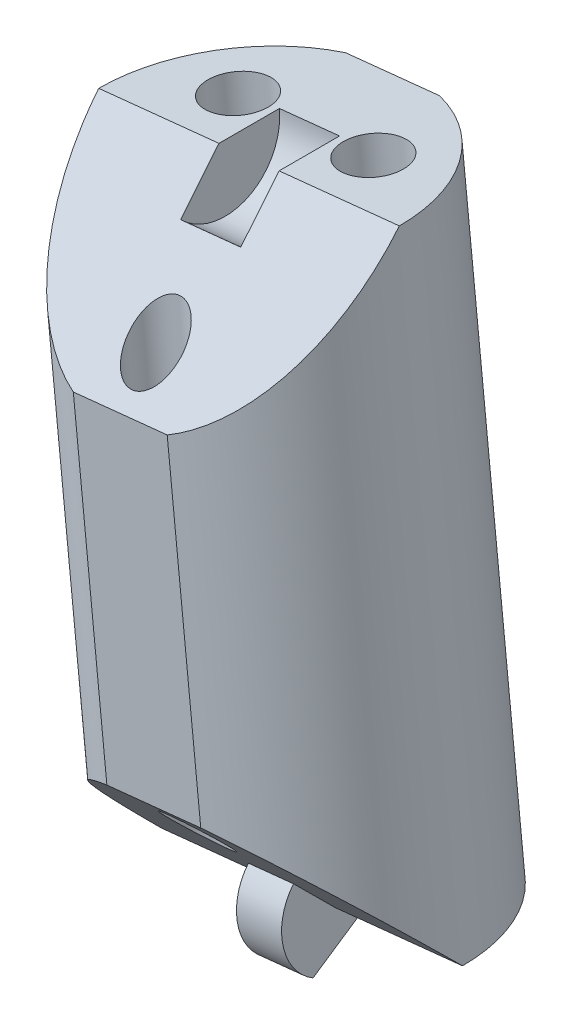
ISO-10303-21;
HEADER;
FILE_DESCRIPTION(('STEP AP214'),'2;1');
FILE_NAME('part.step','',(''),(''),'','','');
FILE_SCHEMA(('AUTOMOTIVE_DESIGN { 1 0 10303 214 1 1 1 1 }'));
ENDSEC;
DATA;
#1=APPLICATION_CONTEXT('core data for automotive mechanical design processes');
#2=APPLICATION_PROTOCOL_DEFINITION('international standard','automotive_design',2000,#1);
#3=PRODUCT_CONTEXT('',#1,'mechanical');
#4=PRODUCT('Part','Part','',(#3));
#5=PRODUCT_RELATED_PRODUCT_CATEGORY('part','',(#4));
#6=PRODUCT_DEFINITION_FORMATION('','',#4);
#7=PRODUCT_DEFINITION_CONTEXT('part definition',#1,'design');
#8=PRODUCT_DEFINITION('design','',#6,#7);
#9=PRODUCT_DEFINITION_SHAPE('','',#8);
#10=(LENGTH_UNIT() NAMED_UNIT(*) SI_UNIT(.MILLI.,.METRE.));
#11=(NAMED_UNIT(*) PLANE_ANGLE_UNIT() SI_UNIT($,.RADIAN.));
#12=(NAMED_UNIT(*) SI_UNIT($,.STERADIAN.) SOLID_ANGLE_UNIT());
#13=UNCERTAINTY_MEASURE_WITH_UNIT(LENGTH_MEASURE(1.E-05),#10,'distance_accuracy_value','');
#14=(GEOMETRIC_REPRESENTATION_CONTEXT(3) GLOBAL_UNCERTAINTY_ASSIGNED_CONTEXT((#13)) GLOBAL_UNIT_ASSIGNED_CONTEXT((#10,
#11,#12)) REPRESENTATION_CONTEXT('',''));
#15=CARTESIAN_POINT('',(0.,0.,0.));
#16=DIRECTION('',(0.,0.,1.));
#17=DIRECTION('',(1.,0.,0.));
#18=AXIS2_PLACEMENT_3D('',#15,#16,#17);
#19=CARTESIAN_POINT('',(-6.62434872213592,165.005639601074,0.));
#20=DIRECTION('',(-0.103150523023817,0.994665757729657,0.));
#21=DIRECTION('',(-0.994665757729657,-0.103150523023817,0.));
#22=AXIS2_PLACEMENT_3D('',#19,#20,#21);
#23=CYLINDRICAL_SURFACE('',#22,8.);
#24=CARTESIAN_POINT('',(-6.62434872213592,165.005639601074,0.));
#25=DIRECTION('',(0.103150523023817,-0.994665757729657,0.));
#26=DIRECTION('',(0.994665757729657,0.103150523023817,0.));
#27=AXIS2_PLACEMENT_3D('',#24,#25,#26);
#28=CIRCLE('',#27,8.);
#29=CARTESIAN_POINT('',(-4.13967445569705,165.263309525001,-7.6));
#30=VERTEX_POINT('',#29);
#31=CARTESIAN_POINT('',(1.33297733970134,165.830843785265,0.));
#32=VERTEX_POINT('',#31);
#33=EDGE_CURVE('E156',#30,#32,#28,.T.);
#34=ORIENTED_EDGE('',*,*,#33,.F.);
#35=DIRECTION('',(-0.103150523023817,0.994665757729657,0.));
#36=VECTOR('',#35,1.);
#37=CARTESIAN_POINT('',(-4.13967445569706,165.263309525001,-7.6));
#38=LINE('',#37,#36);
#39=CARTESIAN_POINT('',(-7.48403157112503,197.512467423771,-7.6));
#40=VERTEX_POINT('',#39);
#41=EDGE_CURVE('E11',#30,#40,#38,.T.);
#42=ORIENTED_EDGE('',*,*,#41,.T.);
#43=CARTESIAN_POINT('',(-9.9687058375639,197.254797499844,0.));
#44=DIRECTION('',(0.103150523023817,-0.994665757729657,0.));
#45=DIRECTION('',(0.994665757729657,0.103150523023817,0.));
#46=AXIS2_PLACEMENT_3D('',#43,#44,#45);
#47=CIRCLE('',#46,8.);
#48=CARTESIAN_POINT('',(-2.01137977572664,198.080001684034,0.));
#49=VERTEX_POINT('',#48);
#50=EDGE_CURVE('E148',#40,#49,#47,.T.);
#51=ORIENTED_EDGE('',*,*,#50,.T.);
#52=CARTESIAN_POINT('',(-9.9687058375639,197.254797499844,0.));
#53=DIRECTION('',(0.0729384343130804,-0.703334902304701,-0.707106781186543));
#54=DIRECTION('',(-0.0729384343130795,0.703334902304692,-0.707106781186552));
#55=AXIS2_PLACEMENT_3D('',#52,#53,#54);
#56=ELLIPSE('',#55,11.3137084989847,8.);
#57=CARTESIAN_POINT('',(-6.70008759614404,189.953007665026,7.6));
#58=VERTEX_POINT('',#57);
#59=EDGE_CURVE('E202',#49,#58,#56,.T.);
#60=ORIENTED_EDGE('',*,*,#59,.T.);
#61=DIRECTION('',(-0.103150523023817,0.994665757729657,0.));
#62=VECTOR('',#61,1.);
#63=CARTESIAN_POINT('',(-4.13967445569706,165.263309525001,7.6));
#64=LINE('',#63,#62);
#65=CARTESIAN_POINT('',(-4.92361843067806,172.822769283747,7.6));
#66=VERTEX_POINT('',#65);
#67=EDGE_CURVE('E174',#58,#66,#64,.F.);
#68=ORIENTED_EDGE('',*,*,#67,.T.);
#69=CARTESIAN_POINT('',(-6.62434872213592,165.005639601074,0.));
#70=DIRECTION('',(-0.0729384343130802,0.703334902304699,-0.707106781186544));
#71=DIRECTION('',(-0.0729384343130796,0.703334902304693,0.707106781186551));
#72=AXIS2_PLACEMENT_3D('',#69,#70,#71);
#73=ELLIPSE('',#72,11.3137084989847,8.);
#74=EDGE_CURVE('E207',#66,#32,#73,.T.);
#75=ORIENTED_EDGE('',*,*,#74,.T.);
#76=EDGE_LOOP('',(#34,#42,#51,#60,#68,#75));
#77=FACE_BOUND('',#76,.T.);
#78=ADVANCED_FACE('F39',(#77),#23,.T.);
#79=CARTESIAN_POINT('',(-9.9687058375639,197.254797499844,0.));
#80=DIRECTION('',(0.103150523023817,-0.994665757729657,0.));
#81=DIRECTION('',(0.994665757729657,0.103150523023817,0.));
#82=AXIS2_PLACEMENT_3D('',#79,#80,#81);
#83=PLANE('',#82);
#84=CARTESIAN_POINT('',(-13.5495025653907,196.883455616958,-3.));
#85=DIRECTION('',(0.103150523023817,-0.994665757729657,0.));
#86=DIRECTION('',(0.994665757729657,0.103150523023817,0.));
#87=AXIS2_PLACEMENT_3D('',#84,#85,#86);
#88=CIRCLE('',#87,1.6);
#89=CARTESIAN_POINT('',(-11.9580373530232,197.048496453796,-3.));
#90=VERTEX_POINT('',#89);
#91=EDGE_CURVE('E189',#90,#90,#88,.T.);
#92=ORIENTED_EDGE('',*,*,#91,.T.);
#93=EDGE_LOOP('',(#92));
#94=FACE_BOUND('',#93,.T.);
#95=CARTESIAN_POINT('',(-6.38790910973713,197.62613938273,-3.));
#96=DIRECTION('',(0.103150523023817,-0.994665757729657,0.));
#97=DIRECTION('',(0.994665757729657,0.103150523023817,0.));
#98=AXIS2_PLACEMENT_3D('',#95,#96,#97);
#99=CIRCLE('',#98,1.6);
#100=CARTESIAN_POINT('',(-4.79644389736968,197.791180219568,-3.));
#101=VERTEX_POINT('',#100);
#102=EDGE_CURVE('E184',#101,#101,#99,.T.);
#103=ORIENTED_EDGE('',*,*,#102,.T.);
#104=EDGE_LOOP('',(#103));
#105=FACE_BOUND('',#104,.T.);
#106=ORIENTED_EDGE('',*,*,#50,.F.);
#107=DIRECTION('',(0.994665757729657,0.103150523023816,0.));
#108=VECTOR('',#107,1.);
#109=CARTESIAN_POINT('',(-12.4533801040028,196.997127575917,-7.6));
#110=LINE('',#109,#108);
#111=CARTESIAN_POINT('',(-12.4533801040028,196.997127575917,-7.6));
#112=VERTEX_POINT('',#111);
#113=EDGE_CURVE('E134',#112,#40,#110,.T.);
#114=ORIENTED_EDGE('',*,*,#113,.F.);
#115=CARTESIAN_POINT('',(-17.9260318994012,196.429593315653,0.));
#116=VERTEX_POINT('',#115);
#117=EDGE_CURVE('E146',#116,#112,#47,.T.);
#118=ORIENTED_EDGE('',*,*,#117,.F.);
#119=DIRECTION('',(0.994665757729657,0.103150523023817,0.));
#120=VECTOR('',#119,1.);
#121=CARTESIAN_POINT('',(-9.9687058375639,197.254797499844,0.));
#122=LINE('',#121,#120);
#123=CARTESIAN_POINT('',(-11.5601710499314,197.089756663006,0.));
#124=VERTEX_POINT('',#123);
#125=EDGE_CURVE('E165',#116,#124,#122,.T.);
#126=ORIENTED_EDGE('',*,*,#125,.T.);
#127=DIRECTION('',(0.,0.,-1.));
#128=VECTOR('',#127,1.);
#129=CARTESIAN_POINT('',(-11.5601710499314,197.089756663006,0.));
#130=LINE('',#129,#128);
#131=CARTESIAN_POINT('',(-11.5601710499314,197.089756663006,-3.2));
#132=VERTEX_POINT('',#131);
#133=EDGE_CURVE('E256',#124,#132,#130,.T.);
#134=ORIENTED_EDGE('',*,*,#133,.T.);
#135=DIRECTION('',(-0.994665757729657,-0.103150523023817,0.));
#136=VECTOR('',#135,1.);
#137=CARTESIAN_POINT('',(-8.37724062519646,197.419838336682,-3.2));
#138=LINE('',#137,#136);
#139=CARTESIAN_POINT('',(-8.37724062519646,197.419838336682,-3.2));
#140=VERTEX_POINT('',#139);
#141=EDGE_CURVE('E269',#140,#132,#138,.T.);
#142=ORIENTED_EDGE('',*,*,#141,.F.);
#143=DIRECTION('',(0.,0.,-1.));
#144=VECTOR('',#143,1.);
#145=CARTESIAN_POINT('',(-8.37724062519647,197.419838336682,0.));
#146=LINE('',#145,#144);
#147=CARTESIAN_POINT('',(-8.37724062519647,197.419838336682,0.));
#148=VERTEX_POINT('',#147);
#149=EDGE_CURVE('E257',#148,#140,#146,.T.);
#150=ORIENTED_EDGE('',*,*,#149,.F.);
#151=EDGE_CURVE('E169',#148,#49,#122,.T.);
#152=ORIENTED_EDGE('',*,*,#151,.T.);
#153=EDGE_LOOP('',(#106,#114,#118,#126,#134,#142,#150,#152));
#154=FACE_BOUND('',#153,.T.);
#155=ADVANCED_FACE('F144',(#94,#105,#154),#83,.F.);
#156=CARTESIAN_POINT('',(1.29739327832444,198.423133704455,0.));
#157=DIRECTION('',(0.0729384343130804,-0.703334902304701,-0.707106781186543));
#158=DIRECTION('',(0.,0.708995228875744,-0.705213276556412));
#159=AXIS2_PLACEMENT_3D('',#156,#157,#158);
#160=PLANE('',#159);
#161=CARTESIAN_POINT('',(-9.40137796093292,191.784135832331,5.5));
#162=DIRECTION('',(0.0729384343130804,-0.703334902304701,-0.707106781186543));
#163=DIRECTION('',(-0.0729384343130796,0.703334902304692,-0.707106781186552));
#164=AXIS2_PLACEMENT_3D('',#161,#162,#163);
#165=ELLIPSE('',#164,1.97989898732232,1.4);
#166=CARTESIAN_POINT('',(-9.54578869316626,193.176667893152,4.1));
#167=VERTEX_POINT('',#166);
#168=EDGE_CURVE('E179',#167,#167,#165,.T.);
#169=ORIENTED_EDGE('',*,*,#168,.T.);
#170=EDGE_LOOP('',(#169));
#171=FACE_BOUND('',#170,.T.);
#172=CARTESIAN_POINT('',(-11.6694361290218,189.437667817172,7.6));
#173=VERTEX_POINT('',#172);
#174=EDGE_CURVE('E153',#173,#116,#56,.T.);
#175=ORIENTED_EDGE('',*,*,#174,.F.);
#176=DIRECTION('',(0.994665757729657,0.103150523023817,0.));
#177=VECTOR('',#176,1.);
#178=CARTESIAN_POINT('',(2.08133725330543,190.863673945709,7.6));
#179=LINE('',#178,#177);
#180=EDGE_CURVE('E198',#173,#58,#179,.T.);
#181=ORIENTED_EDGE('',*,*,#180,.T.);
#182=ORIENTED_EDGE('',*,*,#59,.F.);
#183=ORIENTED_EDGE('',*,*,#151,.F.);
#184=DIRECTION('',(-0.0729384343130776,0.703334902304677,-0.707106781186567));
#185=VECTOR('',#184,1.);
#186=CARTESIAN_POINT('',(-8.14383763539462,195.169166649307,2.26274169979702));
#187=LINE('',#186,#185);
#188=CARTESIAN_POINT('',(-8.14383763539462,195.169166649307,2.26274169979702));
#189=VERTEX_POINT('',#188);
#190=EDGE_CURVE('E266',#189,#148,#187,.T.);
#191=ORIENTED_EDGE('',*,*,#190,.F.);
#192=DIRECTION('',(-0.994665757729657,-0.103150523023817,0.));
#193=VECTOR('',#192,1.);
#194=CARTESIAN_POINT('',(-8.14383763539462,195.169166649307,2.26274169979702));
#195=LINE('',#194,#193);
#196=CARTESIAN_POINT('',(-11.3267680601295,194.839084975631,2.26274169979702));
#197=VERTEX_POINT('',#196);
#198=EDGE_CURVE('E278',#189,#197,#195,.T.);
#199=ORIENTED_EDGE('',*,*,#198,.T.);
#200=DIRECTION('',(-0.0729384343130776,0.703334902304677,-0.707106781186567));
#201=VECTOR('',#200,1.);
#202=CARTESIAN_POINT('',(-11.3267680601295,194.839084975631,2.26274169979702));
#203=LINE('',#202,#201);
#204=EDGE_CURVE('E262',#197,#124,#203,.T.);
#205=ORIENTED_EDGE('',*,*,#204,.T.);
#206=ORIENTED_EDGE('',*,*,#125,.F.);
#207=EDGE_LOOP('',(#175,#181,#182,#183,#191,#199,#205,#206));
#208=FACE_BOUND('',#207,.T.);
#209=ADVANCED_FACE('F196',(#171,#208),#160,.F.);
#210=CARTESIAN_POINT('',(-6.62434872213592,165.005639601074,0.));
#211=DIRECTION('',(0.103150523023817,-0.994665757729657,0.));
#212=DIRECTION('',(0.994665757729657,0.103150523023817,0.));
#213=AXIS2_PLACEMENT_3D('',#210,#211,#212);
#214=PLANE('',#213);
#215=DIRECTION('',(-0.994665757729657,-0.103150523023817,0.));
#216=VECTOR('',#215,1.);
#217=CARTESIAN_POINT('',(-6.62434872213592,165.005639601074,-7.6));
#218=LINE('',#217,#216);
#219=CARTESIAN_POINT('',(-9.10902298857478,164.747969677147,-7.6));
#220=VERTEX_POINT('',#219);
#221=EDGE_CURVE('E55',#30,#220,#218,.T.);
#222=ORIENTED_EDGE('',*,*,#221,.F.);
#223=ORIENTED_EDGE('',*,*,#33,.T.);
#224=DIRECTION('',(0.994665757729657,0.103150523023817,0.));
#225=VECTOR('',#224,1.);
#226=CARTESIAN_POINT('',(-6.62434872213592,165.005639601074,0.));
#227=LINE('',#226,#225);
#228=CARTESIAN_POINT('',(-5.43074981286034,165.129420228703,0.));
#229=VERTEX_POINT('',#228);
#230=EDGE_CURVE('E168',#229,#32,#227,.T.);
#231=ORIENTED_EDGE('',*,*,#230,.F.);
#232=DIRECTION('',(0.,0.,-1.));
#233=VECTOR('',#232,1.);
#234=CARTESIAN_POINT('',(-5.43074981286035,165.129420228703,0.));
#235=LINE('',#234,#233);
#236=CARTESIAN_POINT('',(-5.43074981286035,165.129420228703,-2.8));
#237=VERTEX_POINT('',#236);
#238=EDGE_CURVE('E282',#229,#237,#235,.T.);
#239=ORIENTED_EDGE('',*,*,#238,.T.);
#240=DIRECTION('',(0.994665757729657,0.103150523023817,0.));
#241=VECTOR('',#240,1.);
#242=CARTESIAN_POINT('',(-7.81794763141152,164.881858973446,-2.8));
#243=LINE('',#242,#241);
#244=CARTESIAN_POINT('',(-7.81794763141152,164.881858973446,-2.8));
#245=VERTEX_POINT('',#244);
#246=EDGE_CURVE('E203',#245,#237,#243,.T.);
#247=ORIENTED_EDGE('',*,*,#246,.F.);
#248=DIRECTION('',(0.,0.,-1.));
#249=VECTOR('',#248,1.);
#250=CARTESIAN_POINT('',(-7.81794763141152,164.881858973446,0.));
#251=LINE('',#250,#249);
#252=CARTESIAN_POINT('',(-7.81794763141152,164.881858973446,0.));
#253=VERTEX_POINT('',#252);
#254=EDGE_CURVE('E237',#253,#245,#251,.T.);
#255=ORIENTED_EDGE('',*,*,#254,.F.);
#256=CARTESIAN_POINT('',(-14.5816747839732,164.180435416884,0.));
#257=VERTEX_POINT('',#256);
#258=EDGE_CURVE('E170',#257,#253,#227,.T.);
#259=ORIENTED_EDGE('',*,*,#258,.F.);
#260=EDGE_CURVE('E160',#257,#220,#28,.T.);
#261=ORIENTED_EDGE('',*,*,#260,.T.);
#262=EDGE_LOOP('',(#222,#223,#231,#239,#247,#255,#259,#261));
#263=FACE_BOUND('',#262,.T.);
#264=CARTESIAN_POINT('',(-10.2051454499627,164.634297718189,-3.));
#265=DIRECTION('',(0.103150523023817,-0.994665757729657,0.));
#266=DIRECTION('',(0.994665757729657,0.103150523023817,0.));
#267=AXIS2_PLACEMENT_3D('',#264,#265,#266);
#268=CIRCLE('',#267,1.6);
#269=CARTESIAN_POINT('',(-8.61368023759523,164.799338555027,-3.));
#270=VERTEX_POINT('',#269);
#271=EDGE_CURVE('E185',#270,#270,#268,.T.);
#272=ORIENTED_EDGE('',*,*,#271,.F.);
#273=EDGE_LOOP('',(#272));
#274=FACE_BOUND('',#273,.T.);
#275=CARTESIAN_POINT('',(-3.04355199430916,165.37698148396,-3.));
#276=DIRECTION('',(0.103150523023817,-0.994665757729657,0.));
#277=DIRECTION('',(0.994665757729657,0.103150523023817,0.));
#278=AXIS2_PLACEMENT_3D('',#275,#276,#277);
#279=CIRCLE('',#278,1.6);
#280=CARTESIAN_POINT('',(-1.4520867819417,165.542022320798,-3.));
#281=VERTEX_POINT('',#280);
#282=EDGE_CURVE('E180',#281,#281,#279,.T.);
#283=ORIENTED_EDGE('',*,*,#282,.F.);
#284=EDGE_LOOP('',(#283));
#285=FACE_BOUND('',#284,.T.);
#286=ADVANCED_FACE('F232',(#263,#274,#285),#214,.T.);
#287=CARTESIAN_POINT('',(4.64175039375241,166.173975805685,0.));
#288=DIRECTION('',(-0.0729384343130802,0.703334902304699,-0.707106781186544));
#289=DIRECTION('',(0.,0.708995228875745,0.705213276556411));
#290=AXIS2_PLACEMENT_3D('',#287,#288,#289);
#291=PLANE('',#290);
#292=CARTESIAN_POINT('',(-7.19167659876691,170.476301268587,5.5));
#293=DIRECTION('',(-0.0729384343130802,0.703334902304699,-0.707106781186544));
#294=DIRECTION('',(-0.0729384343130797,0.703334902304693,0.707106781186551));
#295=AXIS2_PLACEMENT_3D('',#292,#293,#294);
#296=ELLIPSE('',#295,1.97989898732232,1.4);
#297=CARTESIAN_POINT('',(-7.33608733100025,171.868833329409,6.9));
#298=VERTEX_POINT('',#297);
#299=EDGE_CURVE('E175',#298,#298,#296,.T.);
#300=ORIENTED_EDGE('',*,*,#299,.T.);
#301=EDGE_LOOP('',(#300));
#302=FACE_BOUND('',#301,.T.);
#303=ORIENTED_EDGE('',*,*,#74,.F.);
#304=DIRECTION('',(-0.994665757729657,-0.103150523023817,0.));
#305=VECTOR('',#304,1.);
#306=CARTESIAN_POINT('',(3.85780641877141,173.73343556443,7.6));
#307=LINE('',#306,#305);
#308=CARTESIAN_POINT('',(-9.89296696355579,172.307429435893,7.6));
#309=VERTEX_POINT('',#308);
#310=EDGE_CURVE('E63',#66,#309,#307,.T.);
#311=ORIENTED_EDGE('',*,*,#310,.T.);
#312=EDGE_CURVE('E162',#257,#309,#73,.T.);
#313=ORIENTED_EDGE('',*,*,#312,.F.);
#314=ORIENTED_EDGE('',*,*,#258,.T.);
#315=DIRECTION('',(0.0729384343130814,-0.703334902304719,-0.707106781186525));
#316=VECTOR('',#315,1.);
#317=CARTESIAN_POINT('',(-8.02217524748815,166.851196699899,1.97989898732228));
#318=LINE('',#317,#316);
#319=CARTESIAN_POINT('',(-8.02217524748815,166.851196699899,1.97989898732228));
#320=VERTEX_POINT('',#319);
#321=EDGE_CURVE('E239',#320,#253,#318,.T.);
#322=ORIENTED_EDGE('',*,*,#321,.F.);
#323=DIRECTION('',(0.994665757729657,0.103150523023817,0.));
#324=VECTOR('',#323,1.);
#325=CARTESIAN_POINT('',(-8.02217524748815,166.851196699899,1.97989898732228));
#326=LINE('',#325,#324);
#327=CARTESIAN_POINT('',(-5.63497742893697,167.098757955156,1.97989898732228));
#328=VERTEX_POINT('',#327);
#329=EDGE_CURVE('E295',#320,#328,#326,.T.);
#330=ORIENTED_EDGE('',*,*,#329,.T.);
#331=DIRECTION('',(0.0729384343130814,-0.703334902304719,-0.707106781186525));
#332=VECTOR('',#331,1.);
#333=CARTESIAN_POINT('',(-5.63497742893697,167.098757955156,1.97989898732228));
#334=LINE('',#333,#332);
#335=EDGE_CURVE('E225',#328,#229,#334,.T.);
#336=ORIENTED_EDGE('',*,*,#335,.T.);
#337=ORIENTED_EDGE('',*,*,#230,.T.);
#338=EDGE_LOOP('',(#303,#311,#313,#314,#322,#330,#336,#337));
#339=FACE_BOUND('',#338,.T.);
#340=ADVANCED_FACE('F222',(#302,#339),#291,.F.);
#341=ORIENTED_EDGE('',*,*,#117,.T.);
#342=DIRECTION('',(-0.103150523023817,0.994665757729657,0.));
#343=VECTOR('',#342,1.);
#344=CARTESIAN_POINT('',(-9.10902298857478,164.747969677147,-7.6));
#345=LINE('',#344,#343);
#346=EDGE_CURVE('E48',#112,#220,#345,.F.);
#347=ORIENTED_EDGE('',*,*,#346,.T.);
#348=ORIENTED_EDGE('',*,*,#260,.F.);
#349=ORIENTED_EDGE('',*,*,#312,.T.);
#350=DIRECTION('',(-0.103150523023817,0.994665757729657,0.));
#351=VECTOR('',#350,1.);
#352=CARTESIAN_POINT('',(-9.10902298857478,164.747969677147,7.6));
#353=LINE('',#352,#351);
#354=EDGE_CURVE('E140',#309,#173,#353,.T.);
#355=ORIENTED_EDGE('',*,*,#354,.T.);
#356=ORIENTED_EDGE('',*,*,#174,.T.);
#357=EDGE_LOOP('',(#341,#347,#348,#349,#355,#356));
#358=FACE_BOUND('',#357,.T.);
#359=ADVANCED_FACE('F41',(#358),#23,.T.);
#360=CARTESIAN_POINT('',(-7.81794763141152,164.881858973446,-2.8));
#361=DIRECTION('',(-0.0893309733522772,0.861405814468384,0.499999999999995));
#362=DIRECTION('',(0.,-0.502007025803858,0.864863541862856));
#363=AXIS2_PLACEMENT_3D('',#360,#361,#362);
#364=PLANE('',#363);
#365=DIRECTION('',(0.0515752615119083,-0.497332878864824,0.866025403784442));
#366=VECTOR('',#365,1.);
#367=CARTESIAN_POINT('',(-5.43074981286035,165.129420228703,-2.8));
#368=LINE('',#367,#366);
#369=CARTESIAN_POINT('',(-5.18062308747397,162.717483948191,1.40000000000003));
#370=VERTEX_POINT('',#369);
#371=EDGE_CURVE('E298',#237,#370,#368,.T.);
#372=ORIENTED_EDGE('',*,*,#371,.T.);
#373=DIRECTION('',(0.994665757729657,0.103150523023817,0.));
#374=VECTOR('',#373,1.);
#375=CARTESIAN_POINT('',(-7.56782090602515,162.469922692934,1.40000000000003));
#376=LINE('',#375,#374);
#377=CARTESIAN_POINT('',(-7.56782090602515,162.469922692934,1.40000000000003));
#378=VERTEX_POINT('',#377);
#379=EDGE_CURVE('E209',#378,#370,#376,.T.);
#380=ORIENTED_EDGE('',*,*,#379,.F.);
#381=DIRECTION('',(0.0515752615119083,-0.497332878864824,0.866025403784442));
#382=VECTOR('',#381,1.);
#383=CARTESIAN_POINT('',(-7.81794763141152,164.881858973446,-2.8));
#384=LINE('',#383,#382);
#385=EDGE_CURVE('E287',#245,#378,#384,.T.);
#386=ORIENTED_EDGE('',*,*,#385,.F.);
#387=ORIENTED_EDGE('',*,*,#246,.T.);
#388=EDGE_LOOP('',(#372,#380,#386,#387));
#389=FACE_BOUND('',#388,.T.);
#390=ADVANCED_FACE('F318',(#389),#364,.F.);
#391=CARTESIAN_POINT('',(-7.81794763141152,164.881858973446,0.));
#392=DIRECTION('',(0.994665757729657,0.103150523023817,0.));
#393=DIRECTION('',(-0.103150523023817,0.994665757729657,0.));
#394=AXIS2_PLACEMENT_3D('',#391,#392,#393);
#395=CYLINDRICAL_SURFACE('',#394,2.8);
#396=CARTESIAN_POINT('',(-5.43074981286035,165.129420228703,0.));
#397=DIRECTION('',(-0.994665757729657,-0.103150523023817,0.));
#398=DIRECTION('',(-0.103150523023817,0.994665757729657,0.));
#399=AXIS2_PLACEMENT_3D('',#396,#397,#398);
#400=CIRCLE('',#399,2.8);
#401=EDGE_CURVE('E301',#370,#328,#400,.T.);
#402=ORIENTED_EDGE('',*,*,#401,.T.);
#403=ORIENTED_EDGE('',*,*,#329,.F.);
#404=CARTESIAN_POINT('',(-7.81794763141152,164.881858973446,0.));
#405=DIRECTION('',(-0.994665757729657,-0.103150523023817,0.));
#406=DIRECTION('',(-0.103150523023817,0.994665757729657,0.));
#407=AXIS2_PLACEMENT_3D('',#404,#405,#406);
#408=CIRCLE('',#407,2.8);
#409=EDGE_CURVE('E290',#378,#320,#408,.T.);
#410=ORIENTED_EDGE('',*,*,#409,.F.);
#411=ORIENTED_EDGE('',*,*,#379,.T.);
#412=EDGE_LOOP('',(#402,#403,#410,#411));
#413=FACE_BOUND('',#412,.T.);
#414=ADVANCED_FACE('F313',(#413),#395,.T.);
#415=CARTESIAN_POINT('',(-7.81794763141152,164.881858973446,0.));
#416=DIRECTION('',(0.994665757729657,0.103150523023817,0.));
#417=DIRECTION('',(-0.103150523023817,0.994665757729657,0.));
#418=AXIS2_PLACEMENT_3D('',#415,#416,#417);
#419=PLANE('',#418);
#420=ORIENTED_EDGE('',*,*,#254,.T.);
#421=ORIENTED_EDGE('',*,*,#385,.T.);
#422=ORIENTED_EDGE('',*,*,#409,.T.);
#423=ORIENTED_EDGE('',*,*,#321,.T.);
#424=EDGE_LOOP('',(#420,#421,#422,#423));
#425=FACE_BOUND('',#424,.T.);
#426=ADVANCED_FACE('F320',(#425),#419,.F.);
#427=CARTESIAN_POINT('',(-5.43074981286035,165.129420228703,0.));
#428=DIRECTION('',(0.994665757729657,0.103150523023817,0.));
#429=DIRECTION('',(-0.103150523023817,0.994665757729657,0.));
#430=AXIS2_PLACEMENT_3D('',#427,#428,#429);
#431=PLANE('',#430);
#432=ORIENTED_EDGE('',*,*,#238,.F.);
#433=ORIENTED_EDGE('',*,*,#335,.F.);
#434=ORIENTED_EDGE('',*,*,#401,.F.);
#435=ORIENTED_EDGE('',*,*,#371,.F.);
#436=EDGE_LOOP('',(#432,#433,#434,#435));
#437=FACE_BOUND('',#436,.T.);
#438=ADVANCED_FACE('F317',(#437),#431,.T.);
#439=CARTESIAN_POINT('',(-8.37724062519647,197.419838336682,0.));
#440=DIRECTION('',(-0.994665757729657,-0.103150523023817,0.));
#441=DIRECTION('',(0.103150523023817,-0.994665757729657,0.));
#442=AXIS2_PLACEMENT_3D('',#439,#440,#441);
#443=CYLINDRICAL_SURFACE('',#442,3.2);
#444=CARTESIAN_POINT('',(-11.5601710499314,197.089756663006,0.));
#445=DIRECTION('',(-0.994665757729657,-0.103150523023817,0.));
#446=DIRECTION('',(0.103150523023817,-0.994665757729657,0.));
#447=AXIS2_PLACEMENT_3D('',#444,#445,#446);
#448=CIRCLE('',#447,3.2);
#449=EDGE_CURVE('E273',#132,#197,#448,.T.);
#450=ORIENTED_EDGE('',*,*,#449,.T.);
#451=ORIENTED_EDGE('',*,*,#198,.F.);
#452=CARTESIAN_POINT('',(-8.37724062519647,197.419838336682,0.));
#453=DIRECTION('',(-0.994665757729657,-0.103150523023817,0.));
#454=DIRECTION('',(0.103150523023817,-0.994665757729657,0.));
#455=AXIS2_PLACEMENT_3D('',#452,#453,#454);
#456=CIRCLE('',#455,3.2);
#457=EDGE_CURVE('E261',#140,#189,#456,.T.);
#458=ORIENTED_EDGE('',*,*,#457,.F.);
#459=ORIENTED_EDGE('',*,*,#141,.T.);
#460=EDGE_LOOP('',(#450,#451,#458,#459));
#461=FACE_BOUND('',#460,.T.);
#462=ADVANCED_FACE('F327',(#461),#443,.F.);
#463=CARTESIAN_POINT('',(-8.37724062519647,197.419838336682,0.));
#464=DIRECTION('',(-0.994665757729657,-0.103150523023817,0.));
#465=DIRECTION('',(0.103150523023817,-0.994665757729657,0.));
#466=AXIS2_PLACEMENT_3D('',#463,#464,#465);
#467=PLANE('',#466);
#468=ORIENTED_EDGE('',*,*,#149,.T.);
#469=ORIENTED_EDGE('',*,*,#457,.T.);
#470=ORIENTED_EDGE('',*,*,#190,.T.);
#471=EDGE_LOOP('',(#468,#469,#470));
#472=FACE_BOUND('',#471,.T.);
#473=ADVANCED_FACE('F368',(#472),#467,.T.);
#474=CARTESIAN_POINT('',(-11.5601710499314,197.089756663006,0.));
#475=DIRECTION('',(-0.994665757729657,-0.103150523023817,0.));
#476=DIRECTION('',(0.103150523023817,-0.994665757729657,0.));
#477=AXIS2_PLACEMENT_3D('',#474,#475,#476);
#478=PLANE('',#477);
#479=ORIENTED_EDGE('',*,*,#133,.F.);
#480=ORIENTED_EDGE('',*,*,#204,.F.);
#481=ORIENTED_EDGE('',*,*,#449,.F.);
#482=EDGE_LOOP('',(#479,#480,#481));
#483=FACE_BOUND('',#482,.T.);
#484=ADVANCED_FACE('F358',(#483),#478,.F.);
#485=CARTESIAN_POINT('',(-6.27951723282998,161.680478811338,5.5));
#486=DIRECTION('',(-0.103150523023817,0.994665757729657,0.));
#487=DIRECTION('',(-0.994665757729657,-0.103150523023817,0.));
#488=AXIS2_PLACEMENT_3D('',#485,#486,#487);
#489=CYLINDRICAL_SURFACE('',#488,1.4);
#490=ORIENTED_EDGE('',*,*,#299,.F.);
#491=EDGE_LOOP('',(#490));
#492=FACE_BOUND('',#491,.T.);
#493=ORIENTED_EDGE('',*,*,#168,.F.);
#494=EDGE_LOOP('',(#493));
#495=FACE_BOUND('',#494,.T.);
#496=ADVANCED_FACE('F355',(#492,#495),#489,.F.);
#497=CARTESIAN_POINT('',(-2.69872050500322,162.051820694224,-3.));
#498=DIRECTION('',(-0.103150523023817,0.994665757729657,0.));
#499=DIRECTION('',(-0.994665757729657,-0.103150523023817,0.));
#500=AXIS2_PLACEMENT_3D('',#497,#498,#499);
#501=CYLINDRICAL_SURFACE('',#500,1.6);
#502=ORIENTED_EDGE('',*,*,#282,.T.);
#503=EDGE_LOOP('',(#502));
#504=FACE_BOUND('',#503,.T.);
#505=ORIENTED_EDGE('',*,*,#102,.F.);
#506=EDGE_LOOP('',(#505));
#507=FACE_BOUND('',#506,.T.);
#508=ADVANCED_FACE('F357',(#504,#507),#501,.F.);
#509=CARTESIAN_POINT('',(-9.86031396065675,161.309136928453,-3.));
#510=DIRECTION('',(-0.103150523023817,0.994665757729657,0.));
#511=DIRECTION('',(-0.994665757729657,-0.103150523023817,0.));
#512=AXIS2_PLACEMENT_3D('',#509,#510,#511);
#513=CYLINDRICAL_SURFACE('',#512,1.6);
#514=ORIENTED_EDGE('',*,*,#271,.T.);
#515=EDGE_LOOP('',(#514));
#516=FACE_BOUND('',#515,.T.);
#517=ORIENTED_EDGE('',*,*,#91,.F.);
#518=EDGE_LOOP('',(#517));
#519=FACE_BOUND('',#518,.T.);
#520=ADVANCED_FACE('F365',(#516,#519),#513,.F.);
#521=CARTESIAN_POINT('',(-8.76419149926885,161.422808887411,7.6));
#522=DIRECTION('',(0.,0.,-1.));
#523=DIRECTION('',(-1.,0.,0.));
#524=AXIS2_PLACEMENT_3D('',#521,#522,#523);
#525=PLANE('',#524);
#526=ORIENTED_EDGE('',*,*,#354,.F.);
#527=ORIENTED_EDGE('',*,*,#310,.F.);
#528=ORIENTED_EDGE('',*,*,#67,.F.);
#529=ORIENTED_EDGE('',*,*,#180,.F.);
#530=EDGE_LOOP('',(#526,#527,#528,#529));
#531=FACE_BOUND('',#530,.T.);
#532=ADVANCED_FACE('F374',(#531),#525,.F.);
#533=CARTESIAN_POINT('',(-8.76419149926885,161.422808887411,-7.6));
#534=DIRECTION('',(0.,0.,1.));
#535=DIRECTION('',(1.,0.,0.));
#536=AXIS2_PLACEMENT_3D('',#533,#534,#535);
#537=PLANE('',#536);
#538=ORIENTED_EDGE('',*,*,#221,.T.);
#539=ORIENTED_EDGE('',*,*,#346,.F.);
#540=ORIENTED_EDGE('',*,*,#113,.T.);
#541=ORIENTED_EDGE('',*,*,#41,.F.);
#542=EDGE_LOOP('',(#538,#539,#540,#541));
#543=FACE_BOUND('',#542,.T.);
#544=ADVANCED_FACE('F133',(#543),#537,.F.);
#545=CLOSED_SHELL('',(#78,#155,#209,#286,#340,#359,#390,#414,#426,#438,#462,#473,#484,#496,#508,
#520,#532,#544));
#546=MANIFOLD_SOLID_BREP('B2',#545);
#547=ADVANCED_BREP_SHAPE_REPRESENTATION('',(#18,#546),#14);
#548=SHAPE_DEFINITION_REPRESENTATION(#9,#547);
ENDSEC;
END-ISO-10303-21;
